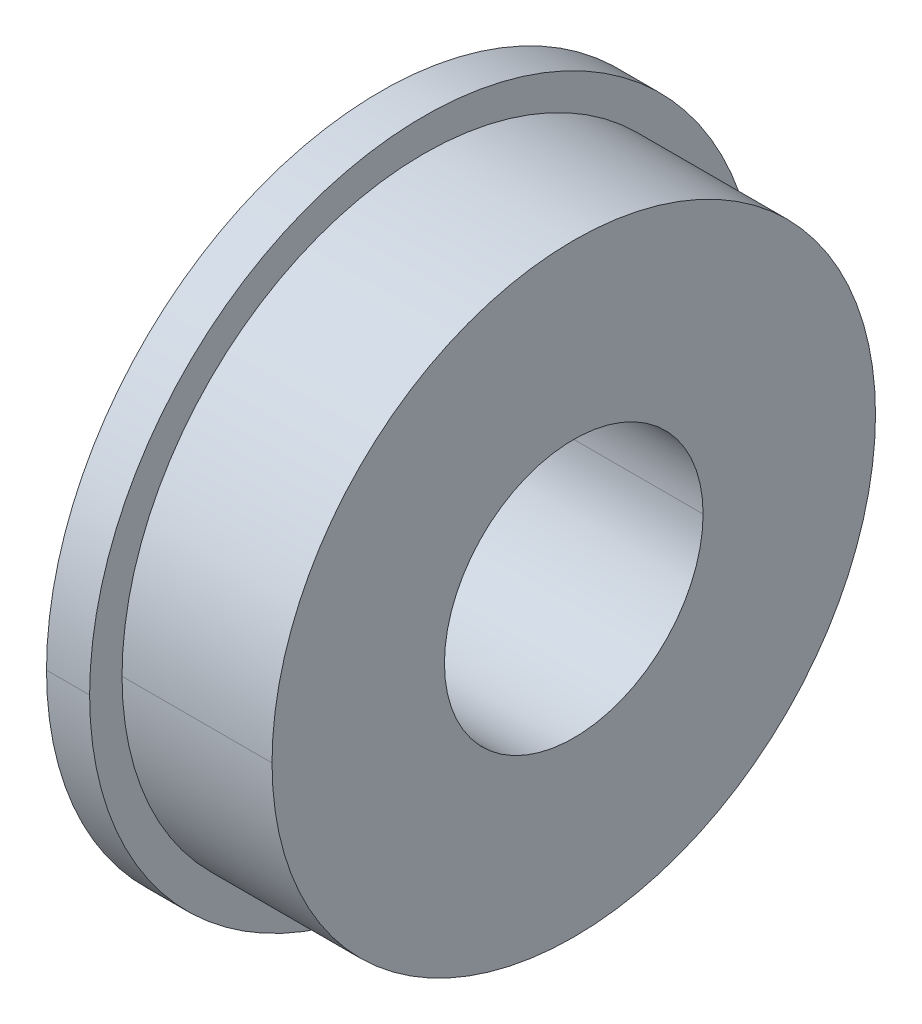
ISO-10303-21;
HEADER;
FILE_DESCRIPTION(('STEP AP214'),'2;1');
FILE_NAME('part.step','',(''),(''),'','','');
FILE_SCHEMA(('AUTOMOTIVE_DESIGN { 1 0 10303 214 1 1 1 1 }'));
ENDSEC;
DATA;
#1=APPLICATION_CONTEXT('core data for automotive mechanical design processes');
#2=APPLICATION_PROTOCOL_DEFINITION('international standard','automotive_design',2000,#1);
#3=PRODUCT_CONTEXT('',#1,'mechanical');
#4=PRODUCT('Part','Part','',(#3));
#5=PRODUCT_RELATED_PRODUCT_CATEGORY('part','',(#4));
#6=PRODUCT_DEFINITION_FORMATION('','',#4);
#7=PRODUCT_DEFINITION_CONTEXT('part definition',#1,'design');
#8=PRODUCT_DEFINITION('design','',#6,#7);
#9=PRODUCT_DEFINITION_SHAPE('','',#8);
#10=(LENGTH_UNIT() NAMED_UNIT(*) SI_UNIT(.MILLI.,.METRE.));
#11=(NAMED_UNIT(*) PLANE_ANGLE_UNIT() SI_UNIT($,.RADIAN.));
#12=(NAMED_UNIT(*) SI_UNIT($,.STERADIAN.) SOLID_ANGLE_UNIT());
#13=UNCERTAINTY_MEASURE_WITH_UNIT(LENGTH_MEASURE(1.E-05),#10,'distance_accuracy_value','');
#14=(GEOMETRIC_REPRESENTATION_CONTEXT(3) GLOBAL_UNCERTAINTY_ASSIGNED_CONTEXT((#13)) GLOBAL_UNIT_ASSIGNED_CONTEXT((#10,
#11,#12)) REPRESENTATION_CONTEXT('',''));
#15=CARTESIAN_POINT('',(0.,0.,0.));
#16=DIRECTION('',(0.,0.,1.));
#17=DIRECTION('',(1.,0.,0.));
#18=AXIS2_PLACEMENT_3D('',#15,#16,#17);
#19=CARTESIAN_POINT('',(0.,0.,0.));
#20=DIRECTION('',(-1.,0.,0.));
#21=DIRECTION('',(0.,0.,1.));
#22=AXIS2_PLACEMENT_3D('',#19,#20,#21);
#23=CYLINDRICAL_SURFACE('',#22,6.35);
#24=CARTESIAN_POINT('',(0.381,0.,0.));
#25=DIRECTION('',(-1.,0.,0.));
#26=DIRECTION('',(0.,0.,1.));
#27=AXIS2_PLACEMENT_3D('',#24,#25,#26);
#28=CIRCLE('',#27,6.35);
#29=CARTESIAN_POINT('',(0.381,0.,6.35));
#30=VERTEX_POINT('',#29);
#31=CARTESIAN_POINT('',(0.381,0.,-6.35));
#32=VERTEX_POINT('',#31);
#33=EDGE_CURVE('E11',#30,#32,#28,.T.);
#34=ORIENTED_EDGE('',*,*,#33,.T.);
#35=DIRECTION('',(-1.,0.,0.));
#36=VECTOR('',#35,1.);
#37=CARTESIAN_POINT('',(0.,0.,-6.35));
#38=LINE('',#37,#36);
#39=CARTESIAN_POINT('',(0.,0.,-6.35));
#40=VERTEX_POINT('',#39);
#41=EDGE_CURVE('E27',#32,#40,#38,.T.);
#42=ORIENTED_EDGE('',*,*,#41,.T.);
#43=CARTESIAN_POINT('',(0.,0.,0.));
#44=DIRECTION('',(-1.,0.,0.));
#45=DIRECTION('',(0.,0.,1.));
#46=AXIS2_PLACEMENT_3D('',#43,#44,#45);
#47=CIRCLE('',#46,6.35);
#48=CARTESIAN_POINT('',(0.,0.,6.35));
#49=VERTEX_POINT('',#48);
#50=EDGE_CURVE('E152',#49,#40,#47,.T.);
#51=ORIENTED_EDGE('',*,*,#50,.F.);
#52=DIRECTION('',(-1.,0.,0.));
#53=VECTOR('',#52,1.);
#54=CARTESIAN_POINT('',(0.,0.,6.35));
#55=LINE('',#54,#53);
#56=EDGE_CURVE('E176',#30,#49,#55,.T.);
#57=ORIENTED_EDGE('',*,*,#56,.F.);
#58=EDGE_LOOP('',(#34,#42,#51,#57));
#59=FACE_BOUND('',#58,.T.);
#60=ADVANCED_FACE('F16',(#59),#23,.T.);
#61=CARTESIAN_POINT('',(0.,0.,0.));
#62=DIRECTION('',(-1.,0.,0.));
#63=DIRECTION('',(0.,0.,1.));
#64=AXIS2_PLACEMENT_3D('',#61,#62,#63);
#65=CYLINDRICAL_SURFACE('',#64,9.906);
#66=CARTESIAN_POINT('',(0.381,0.,0.));
#67=DIRECTION('',(-1.,0.,0.));
#68=DIRECTION('',(0.,0.,1.));
#69=AXIS2_PLACEMENT_3D('',#66,#67,#68);
#70=CIRCLE('',#69,9.906);
#71=CARTESIAN_POINT('',(0.381,0.,-9.906));
#72=VERTEX_POINT('',#71);
#73=CARTESIAN_POINT('',(0.381,0.,9.906));
#74=VERTEX_POINT('',#73);
#75=EDGE_CURVE('E181',#72,#74,#70,.T.);
#76=ORIENTED_EDGE('',*,*,#75,.F.);
#77=DIRECTION('',(-1.,0.,0.));
#78=VECTOR('',#77,1.);
#79=CARTESIAN_POINT('',(0.,0.,-9.906));
#80=LINE('',#79,#78);
#81=CARTESIAN_POINT('',(0.,0.,-9.906));
#82=VERTEX_POINT('',#81);
#83=EDGE_CURVE('E166',#72,#82,#80,.T.);
#84=ORIENTED_EDGE('',*,*,#83,.T.);
#85=CARTESIAN_POINT('',(0.,0.,0.));
#86=DIRECTION('',(-1.,0.,0.));
#87=DIRECTION('',(0.,0.,1.));
#88=AXIS2_PLACEMENT_3D('',#85,#86,#87);
#89=CIRCLE('',#88,9.906);
#90=CARTESIAN_POINT('',(0.,0.,9.906));
#91=VERTEX_POINT('',#90);
#92=EDGE_CURVE('E127',#82,#91,#89,.T.);
#93=ORIENTED_EDGE('',*,*,#92,.T.);
#94=DIRECTION('',(-1.,0.,0.));
#95=VECTOR('',#94,1.);
#96=CARTESIAN_POINT('',(0.,0.,9.906));
#97=LINE('',#96,#95);
#98=EDGE_CURVE('E161',#74,#91,#97,.T.);
#99=ORIENTED_EDGE('',*,*,#98,.F.);
#100=EDGE_LOOP('',(#76,#84,#93,#99));
#101=FACE_BOUND('',#100,.T.);
#102=ADVANCED_FACE('F225',(#101),#65,.F.);
#103=CARTESIAN_POINT('',(0.,0.,0.));
#104=DIRECTION('',(-1.,0.,0.));
#105=DIRECTION('',(0.,0.,1.));
#106=AXIS2_PLACEMENT_3D('',#103,#104,#105);
#107=CYLINDRICAL_SURFACE('',#106,12.3063);
#108=CARTESIAN_POINT('',(1.5875,0.,0.));
#109=DIRECTION('',(-1.,0.,0.));
#110=DIRECTION('',(0.,0.,1.));
#111=AXIS2_PLACEMENT_3D('',#108,#109,#110);
#112=CIRCLE('',#111,12.3063);
#113=CARTESIAN_POINT('',(1.5875,0.,12.3063));
#114=VERTEX_POINT('',#113);
#115=CARTESIAN_POINT('',(1.5875,0.,-12.3063));
#116=VERTEX_POINT('',#115);
#117=EDGE_CURVE('E119',#114,#116,#112,.T.);
#118=ORIENTED_EDGE('',*,*,#117,.T.);
#119=DIRECTION('',(-1.,0.,0.));
#120=VECTOR('',#119,1.);
#121=CARTESIAN_POINT('',(0.,0.,-12.3063));
#122=LINE('',#121,#120);
#123=CARTESIAN_POINT('',(0.,0.,-12.3063));
#124=VERTEX_POINT('',#123);
#125=EDGE_CURVE('E108',#116,#124,#122,.T.);
#126=ORIENTED_EDGE('',*,*,#125,.T.);
#127=CARTESIAN_POINT('',(0.,0.,0.));
#128=DIRECTION('',(-1.,0.,0.));
#129=DIRECTION('',(0.,0.,1.));
#130=AXIS2_PLACEMENT_3D('',#127,#128,#129);
#131=CIRCLE('',#130,12.3063);
#132=CARTESIAN_POINT('',(0.,0.,12.3063));
#133=VERTEX_POINT('',#132);
#134=EDGE_CURVE('E143',#133,#124,#131,.T.);
#135=ORIENTED_EDGE('',*,*,#134,.F.);
#136=DIRECTION('',(-1.,0.,0.));
#137=VECTOR('',#136,1.);
#138=CARTESIAN_POINT('',(0.,0.,12.3063));
#139=LINE('',#138,#137);
#140=EDGE_CURVE('E124',#114,#133,#139,.T.);
#141=ORIENTED_EDGE('',*,*,#140,.F.);
#142=EDGE_LOOP('',(#118,#126,#135,#141));
#143=FACE_BOUND('',#142,.T.);
#144=ADVANCED_FACE('F123',(#143),#107,.T.);
#145=CARTESIAN_POINT('',(0.,0.,0.));
#146=DIRECTION('',(-1.,0.,0.));
#147=DIRECTION('',(0.,0.,1.));
#148=AXIS2_PLACEMENT_3D('',#145,#146,#147);
#149=CYLINDRICAL_SURFACE('',#148,11.1125);
#150=CARTESIAN_POINT('',(7.112,0.,0.));
#151=DIRECTION('',(-1.,0.,0.));
#152=DIRECTION('',(0.,0.,1.));
#153=AXIS2_PLACEMENT_3D('',#150,#151,#152);
#154=CIRCLE('',#153,11.1125);
#155=CARTESIAN_POINT('',(7.112,0.,11.1125));
#156=VERTEX_POINT('',#155);
#157=CARTESIAN_POINT('',(7.112,0.,-11.1125));
#158=VERTEX_POINT('',#157);
#159=EDGE_CURVE('E120',#156,#158,#154,.T.);
#160=ORIENTED_EDGE('',*,*,#159,.T.);
#161=DIRECTION('',(-1.,0.,0.));
#162=VECTOR('',#161,1.);
#163=CARTESIAN_POINT('',(0.,0.,-11.1125));
#164=LINE('',#163,#162);
#165=CARTESIAN_POINT('',(1.5875,0.,-11.1125));
#166=VERTEX_POINT('',#165);
#167=EDGE_CURVE('E148',#158,#166,#164,.T.);
#168=ORIENTED_EDGE('',*,*,#167,.T.);
#169=CARTESIAN_POINT('',(1.5875,0.,0.));
#170=DIRECTION('',(-1.,0.,0.));
#171=DIRECTION('',(0.,0.,1.));
#172=AXIS2_PLACEMENT_3D('',#169,#170,#171);
#173=CIRCLE('',#172,11.1125);
#174=CARTESIAN_POINT('',(1.5875,0.,11.1125));
#175=VERTEX_POINT('',#174);
#176=EDGE_CURVE('E140',#175,#166,#173,.T.);
#177=ORIENTED_EDGE('',*,*,#176,.F.);
#178=DIRECTION('',(-1.,0.,0.));
#179=VECTOR('',#178,1.);
#180=CARTESIAN_POINT('',(0.,0.,11.1125));
#181=LINE('',#180,#179);
#182=EDGE_CURVE('E194',#156,#175,#181,.T.);
#183=ORIENTED_EDGE('',*,*,#182,.F.);
#184=EDGE_LOOP('',(#160,#168,#177,#183));
#185=FACE_BOUND('',#184,.T.);
#186=ADVANCED_FACE('F364',(#185),#149,.T.);
#187=CARTESIAN_POINT('',(0.,0.,0.));
#188=DIRECTION('',(-1.,0.,0.));
#189=DIRECTION('',(0.,0.,1.));
#190=AXIS2_PLACEMENT_3D('',#187,#188,#189);
#191=CYLINDRICAL_SURFACE('',#190,4.7625);
#192=CARTESIAN_POINT('',(7.112,0.,0.));
#193=DIRECTION('',(-1.,0.,0.));
#194=DIRECTION('',(0.,0.,1.));
#195=AXIS2_PLACEMENT_3D('',#192,#193,#194);
#196=CIRCLE('',#195,4.7625);
#197=CARTESIAN_POINT('',(7.112,0.,-4.7625));
#198=VERTEX_POINT('',#197);
#199=CARTESIAN_POINT('',(7.112,0.,4.7625));
#200=VERTEX_POINT('',#199);
#201=EDGE_CURVE('E20',#198,#200,#196,.T.);
#202=ORIENTED_EDGE('',*,*,#201,.F.);
#203=DIRECTION('',(-1.,0.,0.));
#204=VECTOR('',#203,1.);
#205=CARTESIAN_POINT('',(0.,0.,-4.7625));
#206=LINE('',#205,#204);
#207=CARTESIAN_POINT('',(0.,0.,-4.7625));
#208=VERTEX_POINT('',#207);
#209=EDGE_CURVE('E151',#198,#208,#206,.T.);
#210=ORIENTED_EDGE('',*,*,#209,.T.);
#211=CARTESIAN_POINT('',(0.,0.,0.));
#212=DIRECTION('',(-1.,0.,0.));
#213=DIRECTION('',(0.,0.,1.));
#214=AXIS2_PLACEMENT_3D('',#211,#212,#213);
#215=CIRCLE('',#214,4.7625);
#216=CARTESIAN_POINT('',(0.,0.,4.7625));
#217=VERTEX_POINT('',#216);
#218=EDGE_CURVE('E155',#208,#217,#215,.T.);
#219=ORIENTED_EDGE('',*,*,#218,.T.);
#220=DIRECTION('',(-1.,0.,0.));
#221=VECTOR('',#220,1.);
#222=CARTESIAN_POINT('',(0.,0.,4.7625));
#223=LINE('',#222,#221);
#224=EDGE_CURVE('E174',#200,#217,#223,.T.);
#225=ORIENTED_EDGE('',*,*,#224,.F.);
#226=EDGE_LOOP('',(#202,#210,#219,#225));
#227=FACE_BOUND('',#226,.T.);
#228=ADVANCED_FACE('F359',(#227),#191,.F.);
#229=CARTESIAN_POINT('',(0.,6.35,0.));
#230=DIRECTION('',(1.,0.,0.));
#231=DIRECTION('',(0.,1.,0.));
#232=AXIS2_PLACEMENT_3D('',#229,#230,#231);
#233=PLANE('',#232);
#234=ORIENTED_EDGE('',*,*,#50,.T.);
#235=CARTESIAN_POINT('',(0.,0.,0.));
#236=DIRECTION('',(-1.,0.,0.));
#237=DIRECTION('',(0.,0.,1.));
#238=AXIS2_PLACEMENT_3D('',#235,#236,#237);
#239=CIRCLE('',#238,6.35);
#240=EDGE_CURVE('E156',#40,#49,#239,.T.);
#241=ORIENTED_EDGE('',*,*,#240,.T.);
#242=EDGE_LOOP('',(#234,#241));
#243=FACE_BOUND('',#242,.T.);
#244=CARTESIAN_POINT('',(0.,0.,0.));
#245=DIRECTION('',(-1.,0.,0.));
#246=DIRECTION('',(0.,0.,1.));
#247=AXIS2_PLACEMENT_3D('',#244,#245,#246);
#248=CIRCLE('',#247,4.7625);
#249=EDGE_CURVE('E170',#217,#208,#248,.T.);
#250=ORIENTED_EDGE('',*,*,#249,.F.);
#251=ORIENTED_EDGE('',*,*,#218,.F.);
#252=EDGE_LOOP('',(#250,#251));
#253=FACE_BOUND('',#252,.T.);
#254=ADVANCED_FACE('F363',(#243,#253),#233,.F.);
#255=CARTESIAN_POINT('',(0.,0.,0.));
#256=DIRECTION('',(-1.,0.,0.));
#257=DIRECTION('',(0.,0.,1.));
#258=AXIS2_PLACEMENT_3D('',#255,#256,#257);
#259=CYLINDRICAL_SURFACE('',#258,4.7625);
#260=ORIENTED_EDGE('',*,*,#209,.F.);
#261=CARTESIAN_POINT('',(7.112,0.,0.));
#262=DIRECTION('',(-1.,0.,0.));
#263=DIRECTION('',(0.,0.,1.));
#264=AXIS2_PLACEMENT_3D('',#261,#262,#263);
#265=CIRCLE('',#264,4.7625);
#266=EDGE_CURVE('E175',#200,#198,#265,.T.);
#267=ORIENTED_EDGE('',*,*,#266,.F.);
#268=ORIENTED_EDGE('',*,*,#224,.T.);
#269=ORIENTED_EDGE('',*,*,#249,.T.);
#270=EDGE_LOOP('',(#260,#267,#268,#269));
#271=FACE_BOUND('',#270,.T.);
#272=ADVANCED_FACE('F373',(#271),#259,.F.);
#273=CARTESIAN_POINT('',(7.112,4.7625,0.));
#274=DIRECTION('',(-1.,0.,0.));
#275=DIRECTION('',(0.,0.,1.));
#276=AXIS2_PLACEMENT_3D('',#273,#274,#275);
#277=PLANE('',#276);
#278=ORIENTED_EDGE('',*,*,#159,.F.);
#279=CARTESIAN_POINT('',(7.112,0.,0.));
#280=DIRECTION('',(-1.,0.,0.));
#281=DIRECTION('',(0.,0.,1.));
#282=AXIS2_PLACEMENT_3D('',#279,#280,#281);
#283=CIRCLE('',#282,11.1125);
#284=EDGE_CURVE('E200',#158,#156,#283,.T.);
#285=ORIENTED_EDGE('',*,*,#284,.F.);
#286=EDGE_LOOP('',(#278,#285));
#287=FACE_BOUND('',#286,.T.);
#288=ORIENTED_EDGE('',*,*,#266,.T.);
#289=ORIENTED_EDGE('',*,*,#201,.T.);
#290=EDGE_LOOP('',(#288,#289));
#291=FACE_BOUND('',#290,.T.);
#292=ADVANCED_FACE('F354',(#287,#291),#277,.F.);
#293=CARTESIAN_POINT('',(0.,0.,0.));
#294=DIRECTION('',(-1.,0.,0.));
#295=DIRECTION('',(0.,0.,1.));
#296=AXIS2_PLACEMENT_3D('',#293,#294,#295);
#297=CYLINDRICAL_SURFACE('',#296,11.1125);
#298=ORIENTED_EDGE('',*,*,#167,.F.);
#299=ORIENTED_EDGE('',*,*,#284,.T.);
#300=ORIENTED_EDGE('',*,*,#182,.T.);
#301=CARTESIAN_POINT('',(1.5875,0.,0.));
#302=DIRECTION('',(-1.,0.,0.));
#303=DIRECTION('',(0.,0.,1.));
#304=AXIS2_PLACEMENT_3D('',#301,#302,#303);
#305=CIRCLE('',#304,11.1125);
#306=EDGE_CURVE('E132',#166,#175,#305,.T.);
#307=ORIENTED_EDGE('',*,*,#306,.F.);
#308=EDGE_LOOP('',(#298,#299,#300,#307));
#309=FACE_BOUND('',#308,.T.);
#310=ADVANCED_FACE('F350',(#309),#297,.T.);
#311=CARTESIAN_POINT('',(1.5875,11.1125,0.));
#312=DIRECTION('',(-1.,0.,0.));
#313=DIRECTION('',(0.,0.,1.));
#314=AXIS2_PLACEMENT_3D('',#311,#312,#313);
#315=PLANE('',#314);
#316=ORIENTED_EDGE('',*,*,#117,.F.);
#317=CARTESIAN_POINT('',(1.5875,0.,0.));
#318=DIRECTION('',(-1.,0.,0.));
#319=DIRECTION('',(0.,0.,1.));
#320=AXIS2_PLACEMENT_3D('',#317,#318,#319);
#321=CIRCLE('',#320,12.3063);
#322=EDGE_CURVE('E113',#116,#114,#321,.T.);
#323=ORIENTED_EDGE('',*,*,#322,.F.);
#324=EDGE_LOOP('',(#316,#323));
#325=FACE_BOUND('',#324,.T.);
#326=ORIENTED_EDGE('',*,*,#176,.T.);
#327=ORIENTED_EDGE('',*,*,#306,.T.);
#328=EDGE_LOOP('',(#326,#327));
#329=FACE_BOUND('',#328,.T.);
#330=ADVANCED_FACE('F129',(#325,#329),#315,.F.);
#331=CARTESIAN_POINT('',(0.,0.,0.));
#332=DIRECTION('',(-1.,0.,0.));
#333=DIRECTION('',(0.,0.,1.));
#334=AXIS2_PLACEMENT_3D('',#331,#332,#333);
#335=CYLINDRICAL_SURFACE('',#334,12.3063);
#336=ORIENTED_EDGE('',*,*,#125,.F.);
#337=ORIENTED_EDGE('',*,*,#322,.T.);
#338=ORIENTED_EDGE('',*,*,#140,.T.);
#339=CARTESIAN_POINT('',(0.,0.,0.));
#340=DIRECTION('',(-1.,0.,0.));
#341=DIRECTION('',(0.,0.,1.));
#342=AXIS2_PLACEMENT_3D('',#339,#340,#341);
#343=CIRCLE('',#342,12.3063);
#344=EDGE_CURVE('E115',#124,#133,#343,.T.);
#345=ORIENTED_EDGE('',*,*,#344,.F.);
#346=EDGE_LOOP('',(#336,#337,#338,#345));
#347=FACE_BOUND('',#346,.T.);
#348=ADVANCED_FACE('F110',(#347),#335,.T.);
#349=CARTESIAN_POINT('',(0.,12.3063,0.));
#350=DIRECTION('',(1.,0.,0.));
#351=DIRECTION('',(0.,1.,0.));
#352=AXIS2_PLACEMENT_3D('',#349,#350,#351);
#353=PLANE('',#352);
#354=ORIENTED_EDGE('',*,*,#134,.T.);
#355=ORIENTED_EDGE('',*,*,#344,.T.);
#356=EDGE_LOOP('',(#354,#355));
#357=FACE_BOUND('',#356,.T.);
#358=CARTESIAN_POINT('',(0.,0.,0.));
#359=DIRECTION('',(-1.,0.,0.));
#360=DIRECTION('',(0.,0.,1.));
#361=AXIS2_PLACEMENT_3D('',#358,#359,#360);
#362=CIRCLE('',#361,9.906);
#363=EDGE_CURVE('E157',#91,#82,#362,.T.);
#364=ORIENTED_EDGE('',*,*,#363,.F.);
#365=ORIENTED_EDGE('',*,*,#92,.F.);
#366=EDGE_LOOP('',(#364,#365));
#367=FACE_BOUND('',#366,.T.);
#368=ADVANCED_FACE('F229',(#357,#367),#353,.F.);
#369=CARTESIAN_POINT('',(0.,0.,0.));
#370=DIRECTION('',(-1.,0.,0.));
#371=DIRECTION('',(0.,0.,1.));
#372=AXIS2_PLACEMENT_3D('',#369,#370,#371);
#373=CYLINDRICAL_SURFACE('',#372,9.906);
#374=ORIENTED_EDGE('',*,*,#83,.F.);
#375=CARTESIAN_POINT('',(0.381,0.,0.));
#376=DIRECTION('',(-1.,0.,0.));
#377=DIRECTION('',(0.,0.,1.));
#378=AXIS2_PLACEMENT_3D('',#375,#376,#377);
#379=CIRCLE('',#378,9.906);
#380=EDGE_CURVE('E162',#74,#72,#379,.T.);
#381=ORIENTED_EDGE('',*,*,#380,.F.);
#382=ORIENTED_EDGE('',*,*,#98,.T.);
#383=ORIENTED_EDGE('',*,*,#363,.T.);
#384=EDGE_LOOP('',(#374,#381,#382,#383));
#385=FACE_BOUND('',#384,.T.);
#386=ADVANCED_FACE('F231',(#385),#373,.F.);
#387=CARTESIAN_POINT('',(0.381,9.906,0.));
#388=DIRECTION('',(1.,0.,0.));
#389=DIRECTION('',(0.,1.,0.));
#390=AXIS2_PLACEMENT_3D('',#387,#388,#389);
#391=PLANE('',#390);
#392=ORIENTED_EDGE('',*,*,#380,.T.);
#393=ORIENTED_EDGE('',*,*,#75,.T.);
#394=EDGE_LOOP('',(#392,#393));
#395=FACE_BOUND('',#394,.T.);
#396=ORIENTED_EDGE('',*,*,#33,.F.);
#397=CARTESIAN_POINT('',(0.381,0.,0.));
#398=DIRECTION('',(-1.,0.,0.));
#399=DIRECTION('',(0.,0.,1.));
#400=AXIS2_PLACEMENT_3D('',#397,#398,#399);
#401=CIRCLE('',#400,6.35);
#402=EDGE_CURVE('E179',#32,#30,#401,.T.);
#403=ORIENTED_EDGE('',*,*,#402,.F.);
#404=EDGE_LOOP('',(#396,#403));
#405=FACE_BOUND('',#404,.T.);
#406=ADVANCED_FACE('F18',(#395,#405),#391,.F.);
#407=CARTESIAN_POINT('',(0.,0.,0.));
#408=DIRECTION('',(-1.,0.,0.));
#409=DIRECTION('',(0.,0.,1.));
#410=AXIS2_PLACEMENT_3D('',#407,#408,#409);
#411=CYLINDRICAL_SURFACE('',#410,6.35);
#412=ORIENTED_EDGE('',*,*,#41,.F.);
#413=ORIENTED_EDGE('',*,*,#402,.T.);
#414=ORIENTED_EDGE('',*,*,#56,.T.);
#415=ORIENTED_EDGE('',*,*,#240,.F.);
#416=EDGE_LOOP('',(#412,#413,#414,#415));
#417=FACE_BOUND('',#416,.T.);
#418=ADVANCED_FACE('F339',(#417),#411,.T.);
#419=CLOSED_SHELL('',(#60,#102,#144,#186,#228,#254,#272,#292,#310,#330,#348,#368,#386,#406,#418));
#420=MANIFOLD_SOLID_BREP('B1',#419);
#421=ADVANCED_BREP_SHAPE_REPRESENTATION('',(#18,#420),#14);
#422=SHAPE_DEFINITION_REPRESENTATION(#9,#421);
ENDSEC;
END-ISO-10303-21;
